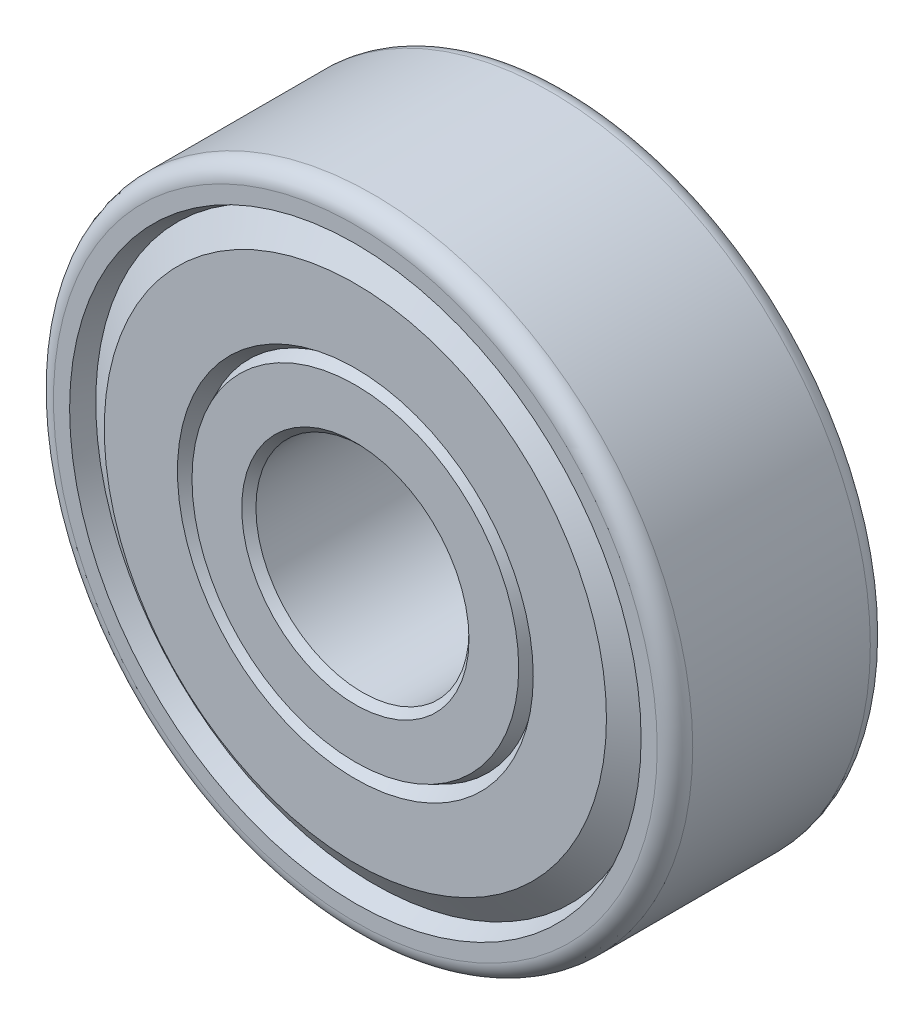
ISO-10303-21;
HEADER;
FILE_DESCRIPTION(('STEP AP214'),'2;1');
FILE_NAME('part.step','',(''),(''),'','','');
FILE_SCHEMA(('AUTOMOTIVE_DESIGN { 1 0 10303 214 1 1 1 1 }'));
ENDSEC;
DATA;
#1=APPLICATION_CONTEXT('core data for automotive mechanical design processes');
#2=APPLICATION_PROTOCOL_DEFINITION('international standard','automotive_design',2000,#1);
#3=PRODUCT_CONTEXT('',#1,'mechanical');
#4=PRODUCT('Part','Part','',(#3));
#5=PRODUCT_RELATED_PRODUCT_CATEGORY('part','',(#4));
#6=PRODUCT_DEFINITION_FORMATION('','',#4);
#7=PRODUCT_DEFINITION_CONTEXT('part definition',#1,'design');
#8=PRODUCT_DEFINITION('design','',#6,#7);
#9=PRODUCT_DEFINITION_SHAPE('','',#8);
#10=(LENGTH_UNIT() NAMED_UNIT(*) SI_UNIT(.MILLI.,.METRE.));
#11=(NAMED_UNIT(*) PLANE_ANGLE_UNIT() SI_UNIT($,.RADIAN.));
#12=(NAMED_UNIT(*) SI_UNIT($,.STERADIAN.) SOLID_ANGLE_UNIT());
#13=UNCERTAINTY_MEASURE_WITH_UNIT(LENGTH_MEASURE(1.E-05),#10,'distance_accuracy_value','');
#14=(GEOMETRIC_REPRESENTATION_CONTEXT(3) GLOBAL_UNCERTAINTY_ASSIGNED_CONTEXT((#13)) GLOBAL_UNIT_ASSIGNED_CONTEXT((#10,
#11,#12)) REPRESENTATION_CONTEXT('',''));
#15=CARTESIAN_POINT('',(0.,0.,0.));
#16=DIRECTION('',(0.,0.,1.));
#17=DIRECTION('',(1.,0.,0.));
#18=AXIS2_PLACEMENT_3D('',#15,#16,#17);
#19=CARTESIAN_POINT('',(7.3025,0.,-4.7624999995719));
#20=DIRECTION('',(0.,0.,-1.));
#21=DIRECTION('',(-1.,0.,0.));
#22=AXIS2_PLACEMENT_3D('',#19,#20,#21);
#23=PLANE('',#22);
#24=CARTESIAN_POINT('',(0.,0.,-4.7624999995719));
#25=DIRECTION('',(0.,0.,1.));
#26=DIRECTION('',(1.,0.,0.));
#27=AXIS2_PLACEMENT_3D('',#24,#25,#26);
#28=CIRCLE('',#27,5.07999999979347);
#29=CARTESIAN_POINT('',(5.07999999979347,0.,-4.7624999995719));
#30=VERTEX_POINT('',#29);
#31=EDGE_CURVE('E10',#30,#30,#28,.T.);
#32=ORIENTED_EDGE('',*,*,#31,.T.);
#33=EDGE_LOOP('',(#32));
#34=FACE_BOUND('',#33,.T.);
#35=CARTESIAN_POINT('',(0.,0.,-4.7624999995719));
#36=DIRECTION('',(0.,0.,1.));
#37=DIRECTION('',(1.,0.,0.));
#38=AXIS2_PLACEMENT_3D('',#35,#36,#37);
#39=CIRCLE('',#38,7.3025);
#40=CARTESIAN_POINT('',(7.3025,0.,-4.7624999995719));
#41=VERTEX_POINT('',#40);
#42=EDGE_CURVE('E94',#41,#41,#39,.T.);
#43=ORIENTED_EDGE('',*,*,#42,.F.);
#44=EDGE_LOOP('',(#43));
#45=FACE_BOUND('',#44,.T.);
#46=ADVANCED_FACE('F30',(#34,#45),#23,.T.);
#47=CARTESIAN_POINT('',(0.,0.,-4.7624999995719));
#48=DIRECTION('',(0.,0.,-1.));
#49=DIRECTION('',(-1.,0.,0.));
#50=AXIS2_PLACEMENT_3D('',#47,#48,#49);
#51=CONICAL_SURFACE('',#50,5.07999999979347,0.785398163397448);
#52=CARTESIAN_POINT('',(0.,0.,-4.4449999995777));
#53=DIRECTION('',(0.,0.,1.));
#54=DIRECTION('',(1.,0.,0.));
#55=AXIS2_PLACEMENT_3D('',#52,#53,#54);
#56=CIRCLE('',#55,4.76249999979927);
#57=CARTESIAN_POINT('',(4.76249999979927,0.,-4.4449999995777));
#58=VERTEX_POINT('',#57);
#59=EDGE_CURVE('E36',#58,#58,#56,.T.);
#60=ORIENTED_EDGE('',*,*,#59,.T.);
#61=EDGE_LOOP('',(#60));
#62=FACE_BOUND('',#61,.T.);
#63=ORIENTED_EDGE('',*,*,#31,.F.);
#64=EDGE_LOOP('',(#63));
#65=FACE_BOUND('',#64,.T.);
#66=ADVANCED_FACE('F102',(#62,#65),#51,.F.);
#67=CARTESIAN_POINT('',(0.,0.,-4.76375000000002));
#68=DIRECTION('',(0.,0.,1.));
#69=DIRECTION('',(1.,0.,0.));
#70=AXIS2_PLACEMENT_3D('',#67,#68,#69);
#71=CYLINDRICAL_SURFACE('',#70,4.76249999979927);
#72=CARTESIAN_POINT('',(0.,0.,4.44500000014614));
#73=DIRECTION('',(0.,0.,1.));
#74=DIRECTION('',(1.,0.,0.));
#75=AXIS2_PLACEMENT_3D('',#72,#73,#74);
#76=CIRCLE('',#75,4.76249999979927);
#77=CARTESIAN_POINT('',(4.76249999979927,0.,4.44500000014614));
#78=VERTEX_POINT('',#77);
#79=EDGE_CURVE('E40',#78,#78,#76,.T.);
#80=ORIENTED_EDGE('',*,*,#79,.T.);
#81=EDGE_LOOP('',(#80));
#82=FACE_BOUND('',#81,.T.);
#83=ORIENTED_EDGE('',*,*,#59,.F.);
#84=EDGE_LOOP('',(#83));
#85=FACE_BOUND('',#84,.T.);
#86=ADVANCED_FACE('F106',(#82,#85),#71,.F.);
#87=CARTESIAN_POINT('',(0.,0.,4.44500000014614));
#88=DIRECTION('',(0.,0.,1.));
#89=DIRECTION('',(1.,0.,0.));
#90=AXIS2_PLACEMENT_3D('',#87,#88,#89);
#91=CONICAL_SURFACE('',#90,4.76249999979927,0.785398163397448);
#92=CARTESIAN_POINT('',(0.,0.,4.76250000014034));
#93=DIRECTION('',(0.,0.,1.));
#94=DIRECTION('',(1.,0.,0.));
#95=AXIS2_PLACEMENT_3D('',#92,#93,#94);
#96=CIRCLE('',#95,5.07999999979347);
#97=CARTESIAN_POINT('',(5.07999999979347,0.,4.76250000014034));
#98=VERTEX_POINT('',#97);
#99=EDGE_CURVE('E44',#98,#98,#96,.T.);
#100=ORIENTED_EDGE('',*,*,#99,.T.);
#101=EDGE_LOOP('',(#100));
#102=FACE_BOUND('',#101,.T.);
#103=ORIENTED_EDGE('',*,*,#79,.F.);
#104=EDGE_LOOP('',(#103));
#105=FACE_BOUND('',#104,.T.);
#106=ADVANCED_FACE('F110',(#102,#105),#91,.F.);
#107=CARTESIAN_POINT('',(5.07999999979347,0.,4.76250000014034));
#108=DIRECTION('',(0.,0.,1.));
#109=DIRECTION('',(1.,0.,0.));
#110=AXIS2_PLACEMENT_3D('',#107,#108,#109);
#111=PLANE('',#110);
#112=CARTESIAN_POINT('',(0.,0.,4.76250000014034));
#113=DIRECTION('',(0.,0.,1.));
#114=DIRECTION('',(1.,0.,0.));
#115=AXIS2_PLACEMENT_3D('',#112,#113,#114);
#116=CIRCLE('',#115,7.30250000013546);
#117=CARTESIAN_POINT('',(7.30250000013546,0.,4.76250000014034));
#118=VERTEX_POINT('',#117);
#119=EDGE_CURVE('E49',#118,#118,#116,.T.);
#120=ORIENTED_EDGE('',*,*,#119,.T.);
#121=EDGE_LOOP('',(#120));
#122=FACE_BOUND('',#121,.T.);
#123=ORIENTED_EDGE('',*,*,#99,.F.);
#124=EDGE_LOOP('',(#123));
#125=FACE_BOUND('',#124,.T.);
#126=ADVANCED_FACE('F117',(#122,#125),#111,.T.);
#127=CARTESIAN_POINT('',(0.,0.,4.76250000014034));
#128=DIRECTION('',(0.,0.,-1.));
#129=DIRECTION('',(-1.,0.,0.));
#130=AXIS2_PLACEMENT_3D('',#127,#128,#129);
#131=CONICAL_SURFACE('',#130,7.30250000013546,0.407917424795081);
#132=CARTESIAN_POINT('',(0.,0.,4.18132890082251));
#133=DIRECTION('',(0.,0.,1.));
#134=DIRECTION('',(1.,0.,0.));
#135=AXIS2_PLACEMENT_3D('',#132,#133,#134);
#136=CIRCLE('',#135,7.55365742482294);
#137=CARTESIAN_POINT('',(7.55365742482294,0.,4.18132890082251));
#138=VERTEX_POINT('',#137);
#139=EDGE_CURVE('E52',#138,#138,#136,.T.);
#140=ORIENTED_EDGE('',*,*,#139,.T.);
#141=EDGE_LOOP('',(#140));
#142=FACE_BOUND('',#141,.T.);
#143=ORIENTED_EDGE('',*,*,#119,.F.);
#144=EDGE_LOOP('',(#143));
#145=FACE_BOUND('',#144,.T.);
#146=ADVANCED_FACE('F121',(#142,#145),#131,.T.);
#147=CARTESIAN_POINT('',(0.,0.,4.18132890082251));
#148=DIRECTION('',(0.,0.,1.));
#149=DIRECTION('',(1.,0.,0.));
#150=AXIS2_PLACEMENT_3D('',#147,#148,#149);
#151=CONICAL_SURFACE('',#150,7.55365742482294,0.601029540180864);
#152=CARTESIAN_POINT('',(0.,0.,4.76250000014034));
#153=DIRECTION('',(0.,0.,1.));
#154=DIRECTION('',(1.,0.,0.));
#155=AXIS2_PLACEMENT_3D('',#152,#153,#154);
#156=CIRCLE('',#155,7.95213697272844);
#157=CARTESIAN_POINT('',(7.95213697272844,0.,4.76250000014034));
#158=VERTEX_POINT('',#157);
#159=EDGE_CURVE('E55',#158,#158,#156,.T.);
#160=ORIENTED_EDGE('',*,*,#159,.T.);
#161=EDGE_LOOP('',(#160));
#162=FACE_BOUND('',#161,.T.);
#163=ORIENTED_EDGE('',*,*,#139,.F.);
#164=EDGE_LOOP('',(#163));
#165=FACE_BOUND('',#164,.T.);
#166=ADVANCED_FACE('F125',(#162,#165),#151,.F.);
#167=CARTESIAN_POINT('',(7.95213697272844,0.,4.76250000014034));
#168=DIRECTION('',(0.,0.,1.));
#169=DIRECTION('',(1.,0.,0.));
#170=AXIS2_PLACEMENT_3D('',#167,#168,#169);
#171=PLANE('',#170);
#172=CARTESIAN_POINT('',(0.,0.,4.76250000014034));
#173=DIRECTION('',(0.,0.,1.));
#174=DIRECTION('',(1.,0.,0.));
#175=AXIS2_PLACEMENT_3D('',#172,#173,#174);
#176=CIRCLE('',#175,11.2241326948103);
#177=CARTESIAN_POINT('',(11.2241326948103,0.,4.76250000014034));
#178=VERTEX_POINT('',#177);
#179=EDGE_CURVE('E58',#178,#178,#176,.T.);
#180=ORIENTED_EDGE('',*,*,#179,.T.);
#181=EDGE_LOOP('',(#180));
#182=FACE_BOUND('',#181,.T.);
#183=ORIENTED_EDGE('',*,*,#159,.F.);
#184=EDGE_LOOP('',(#183));
#185=FACE_BOUND('',#184,.T.);
#186=ADVANCED_FACE('F129',(#182,#185),#171,.T.);
#187=CARTESIAN_POINT('',(0.,0.,4.76250000014034));
#188=DIRECTION('',(0.,0.,-1.));
#189=DIRECTION('',(-1.,0.,0.));
#190=AXIS2_PLACEMENT_3D('',#187,#188,#189);
#191=CONICAL_SURFACE('',#190,11.2241326948103,0.969766785464896);
#192=CARTESIAN_POINT('',(0.,0.,3.93017144165326));
#193=DIRECTION('',(0.,0.,1.));
#194=DIRECTION('',(1.,0.,0.));
#195=AXIS2_PLACEMENT_3D('',#192,#193,#194);
#196=CIRCLE('',#195,12.4380602468774);
#197=CARTESIAN_POINT('',(12.4380602468774,0.,3.93017144165326));
#198=VERTEX_POINT('',#197);
#199=EDGE_CURVE('E61',#198,#198,#196,.T.);
#200=ORIENTED_EDGE('',*,*,#199,.T.);
#201=EDGE_LOOP('',(#200));
#202=FACE_BOUND('',#201,.T.);
#203=ORIENTED_EDGE('',*,*,#179,.F.);
#204=EDGE_LOOP('',(#203));
#205=FACE_BOUND('',#204,.T.);
#206=ADVANCED_FACE('F133',(#202,#205),#191,.T.);
#207=CARTESIAN_POINT('',(0.,0.,3.93017144165326));
#208=DIRECTION('',(0.,0.,1.));
#209=DIRECTION('',(1.,0.,0.));
#210=AXIS2_PLACEMENT_3D('',#207,#208,#209);
#211=CONICAL_SURFACE('',#210,12.4380602468774,0.382519397582066);
#212=CARTESIAN_POINT('',(0.,0.,4.76250000014034));
#213=DIRECTION('',(0.,0.,1.));
#214=DIRECTION('',(1.,0.,0.));
#215=AXIS2_PLACEMENT_3D('',#212,#213,#214);
#216=CIRCLE('',#215,12.7729368126781);
#217=CARTESIAN_POINT('',(12.7729368126781,0.,4.76250000014034));
#218=VERTEX_POINT('',#217);
#219=EDGE_CURVE('E64',#218,#218,#216,.T.);
#220=ORIENTED_EDGE('',*,*,#219,.T.);
#221=EDGE_LOOP('',(#220));
#222=FACE_BOUND('',#221,.T.);
#223=ORIENTED_EDGE('',*,*,#199,.F.);
#224=EDGE_LOOP('',(#223));
#225=FACE_BOUND('',#224,.T.);
#226=ADVANCED_FACE('F137',(#222,#225),#211,.F.);
#227=CARTESIAN_POINT('',(12.7729368126781,0.,4.76250000014034));
#228=DIRECTION('',(0.,0.,1.));
#229=DIRECTION('',(1.,0.,0.));
#230=AXIS2_PLACEMENT_3D('',#227,#228,#229);
#231=PLANE('',#230);
#232=CARTESIAN_POINT('',(0.,0.,4.76250000014033));
#233=DIRECTION('',(0.,0.,1.));
#234=DIRECTION('',(1.,0.,0.));
#235=AXIS2_PLACEMENT_3D('',#232,#233,#234);
#236=CIRCLE('',#235,13.49375);
#237=CARTESIAN_POINT('',(13.49375,0.,4.76250000014033));
#238=VERTEX_POINT('',#237);
#239=EDGE_CURVE('E67',#238,#238,#236,.T.);
#240=ORIENTED_EDGE('',*,*,#239,.T.);
#241=EDGE_LOOP('',(#240));
#242=FACE_BOUND('',#241,.T.);
#243=ORIENTED_EDGE('',*,*,#219,.F.);
#244=EDGE_LOOP('',(#243));
#245=FACE_BOUND('',#244,.T.);
#246=ADVANCED_FACE('F141',(#242,#245),#231,.T.);
#247=CARTESIAN_POINT('',(0.,0.,3.96875000014034));
#248=DIRECTION('',(0.,0.,1.));
#249=DIRECTION('',(1.,0.,0.));
#250=AXIS2_PLACEMENT_3D('',#247,#248,#249);
#251=TOROIDAL_SURFACE('',#250,13.49375,0.793749999999989);
#252=CARTESIAN_POINT('',(0.,0.,3.96875000014034));
#253=DIRECTION('',(0.,0.,1.));
#254=DIRECTION('',(1.,0.,0.));
#255=AXIS2_PLACEMENT_3D('',#252,#253,#254);
#256=CIRCLE('',#255,14.2875);
#257=CARTESIAN_POINT('',(14.2875,0.,3.96875000014034));
#258=VERTEX_POINT('',#257);
#259=EDGE_CURVE('E70',#258,#258,#256,.T.);
#260=ORIENTED_EDGE('',*,*,#259,.T.);
#261=EDGE_LOOP('',(#260));
#262=FACE_BOUND('',#261,.T.);
#263=ORIENTED_EDGE('',*,*,#239,.F.);
#264=EDGE_LOOP('',(#263));
#265=FACE_BOUND('',#264,.T.);
#266=ADVANCED_FACE('F145',(#262,#265),#251,.T.);
#267=CARTESIAN_POINT('',(0.,0.,-4.76375000000002));
#268=DIRECTION('',(0.,0.,1.));
#269=DIRECTION('',(1.,0.,0.));
#270=AXIS2_PLACEMENT_3D('',#267,#268,#269);
#271=CYLINDRICAL_SURFACE('',#270,14.2875);
#272=CARTESIAN_POINT('',(0.,0.,-3.9687499995719));
#273=DIRECTION('',(0.,0.,1.));
#274=DIRECTION('',(1.,0.,0.));
#275=AXIS2_PLACEMENT_3D('',#272,#273,#274);
#276=CIRCLE('',#275,14.2875);
#277=CARTESIAN_POINT('',(14.2875,0.,-3.9687499995719));
#278=VERTEX_POINT('',#277);
#279=EDGE_CURVE('E73',#278,#278,#276,.T.);
#280=ORIENTED_EDGE('',*,*,#279,.T.);
#281=EDGE_LOOP('',(#280));
#282=FACE_BOUND('',#281,.T.);
#283=ORIENTED_EDGE('',*,*,#259,.F.);
#284=EDGE_LOOP('',(#283));
#285=FACE_BOUND('',#284,.T.);
#286=ADVANCED_FACE('F149',(#282,#285),#271,.T.);
#287=CARTESIAN_POINT('',(0.,0.,-3.9687499995719));
#288=DIRECTION('',(0.,0.,1.));
#289=DIRECTION('',(1.,0.,0.));
#290=AXIS2_PLACEMENT_3D('',#287,#288,#289);
#291=TOROIDAL_SURFACE('',#290,13.49375,0.793750000000002);
#292=CARTESIAN_POINT('',(0.,0.,-4.7624999995719));
#293=DIRECTION('',(0.,0.,1.));
#294=DIRECTION('',(1.,0.,0.));
#295=AXIS2_PLACEMENT_3D('',#292,#293,#294);
#296=CIRCLE('',#295,13.49375);
#297=CARTESIAN_POINT('',(13.49375,0.,-4.7624999995719));
#298=VERTEX_POINT('',#297);
#299=EDGE_CURVE('E76',#298,#298,#296,.T.);
#300=ORIENTED_EDGE('',*,*,#299,.T.);
#301=EDGE_LOOP('',(#300));
#302=FACE_BOUND('',#301,.T.);
#303=ORIENTED_EDGE('',*,*,#279,.F.);
#304=EDGE_LOOP('',(#303));
#305=FACE_BOUND('',#304,.T.);
#306=ADVANCED_FACE('F153',(#302,#305),#291,.T.);
#307=CARTESIAN_POINT('',(13.49375,0.,-4.7624999995719));
#308=DIRECTION('',(0.,0.,-1.));
#309=DIRECTION('',(-1.,0.,0.));
#310=AXIS2_PLACEMENT_3D('',#307,#308,#309);
#311=PLANE('',#310);
#312=CARTESIAN_POINT('',(0.,0.,-4.7624999995719));
#313=DIRECTION('',(0.,0.,1.));
#314=DIRECTION('',(1.,0.,0.));
#315=AXIS2_PLACEMENT_3D('',#312,#313,#314);
#316=CIRCLE('',#315,12.7729368128599);
#317=CARTESIAN_POINT('',(12.7729368128599,0.,-4.7624999995719));
#318=VERTEX_POINT('',#317);
#319=EDGE_CURVE('E79',#318,#318,#316,.T.);
#320=ORIENTED_EDGE('',*,*,#319,.T.);
#321=EDGE_LOOP('',(#320));
#322=FACE_BOUND('',#321,.T.);
#323=ORIENTED_EDGE('',*,*,#299,.F.);
#324=EDGE_LOOP('',(#323));
#325=FACE_BOUND('',#324,.T.);
#326=ADVANCED_FACE('F157',(#322,#325),#311,.T.);
#327=CARTESIAN_POINT('',(0.,0.,-4.7624999995719));
#328=DIRECTION('',(0.,0.,-1.));
#329=DIRECTION('',(-1.,0.,0.));
#330=AXIS2_PLACEMENT_3D('',#327,#328,#329);
#331=CONICAL_SURFACE('',#330,12.7729368128599,0.382519398268519);
#332=CARTESIAN_POINT('',(0.,0.,-3.93017144183061));
#333=DIRECTION('',(0.,0.,1.));
#334=DIRECTION('',(1.,0.,0.));
#335=AXIS2_PLACEMENT_3D('',#332,#333,#334);
#336=CIRCLE('',#335,12.4380602466955);
#337=CARTESIAN_POINT('',(12.4380602466955,0.,-3.93017144183061));
#338=VERTEX_POINT('',#337);
#339=EDGE_CURVE('E82',#338,#338,#336,.T.);
#340=ORIENTED_EDGE('',*,*,#339,.T.);
#341=EDGE_LOOP('',(#340));
#342=FACE_BOUND('',#341,.T.);
#343=ORIENTED_EDGE('',*,*,#319,.F.);
#344=EDGE_LOOP('',(#343));
#345=FACE_BOUND('',#344,.T.);
#346=ADVANCED_FACE('F161',(#342,#345),#331,.F.);
#347=CARTESIAN_POINT('',(0.,0.,-3.93017144183061));
#348=DIRECTION('',(0.,0.,1.));
#349=DIRECTION('',(1.,0.,0.));
#350=AXIS2_PLACEMENT_3D('',#347,#348,#349);
#351=CONICAL_SURFACE('',#350,12.4380602466955,0.969766785990075);
#352=CARTESIAN_POINT('',(0.,0.,-4.7624999995719));
#353=DIRECTION('',(0.,0.,1.));
#354=DIRECTION('',(1.,0.,0.));
#355=AXIS2_PLACEMENT_3D('',#352,#353,#354);
#356=CIRCLE('',#355,11.2241326943492);
#357=CARTESIAN_POINT('',(11.2241326943492,0.,-4.7624999995719));
#358=VERTEX_POINT('',#357);
#359=EDGE_CURVE('E85',#358,#358,#356,.T.);
#360=ORIENTED_EDGE('',*,*,#359,.T.);
#361=EDGE_LOOP('',(#360));
#362=FACE_BOUND('',#361,.T.);
#363=ORIENTED_EDGE('',*,*,#339,.F.);
#364=EDGE_LOOP('',(#363));
#365=FACE_BOUND('',#364,.T.);
#366=ADVANCED_FACE('F165',(#362,#365),#351,.T.);
#367=CARTESIAN_POINT('',(11.2241326943492,0.,-4.7624999995719));
#368=DIRECTION('',(0.,0.,-1.));
#369=DIRECTION('',(-1.,0.,0.));
#370=AXIS2_PLACEMENT_3D('',#367,#368,#369);
#371=PLANE('',#370);
#372=CARTESIAN_POINT('',(0.,0.,-4.7624999995719));
#373=DIRECTION('',(0.,0.,1.));
#374=DIRECTION('',(1.,0.,0.));
#375=AXIS2_PLACEMENT_3D('',#372,#373,#374);
#376=CIRCLE('',#375,7.952136972928);
#377=CARTESIAN_POINT('',(7.952136972928,0.,-4.7624999995719));
#378=VERTEX_POINT('',#377);
#379=EDGE_CURVE('E88',#378,#378,#376,.T.);
#380=ORIENTED_EDGE('',*,*,#379,.T.);
#381=EDGE_LOOP('',(#380));
#382=FACE_BOUND('',#381,.T.);
#383=ORIENTED_EDGE('',*,*,#359,.F.);
#384=EDGE_LOOP('',(#383));
#385=FACE_BOUND('',#384,.T.);
#386=ADVANCED_FACE('F169',(#382,#385),#371,.T.);
#387=CARTESIAN_POINT('',(0.,0.,-4.7624999995719));
#388=DIRECTION('',(0.,0.,-1.));
#389=DIRECTION('',(-1.,0.,0.));
#390=AXIS2_PLACEMENT_3D('',#387,#388,#389);
#391=CONICAL_SURFACE('',#390,7.952136972928,0.601029540804809);
#392=CARTESIAN_POINT('',(0.,0.,-4.18132890044945));
#393=DIRECTION('',(0.,0.,1.));
#394=DIRECTION('',(1.,0.,0.));
#395=AXIS2_PLACEMENT_3D('',#392,#393,#394);
#396=CIRCLE('',#395,7.55365742462337);
#397=CARTESIAN_POINT('',(7.55365742462337,0.,-4.18132890044945));
#398=VERTEX_POINT('',#397);
#399=EDGE_CURVE('E91',#398,#398,#396,.T.);
#400=ORIENTED_EDGE('',*,*,#399,.T.);
#401=EDGE_LOOP('',(#400));
#402=FACE_BOUND('',#401,.T.);
#403=ORIENTED_EDGE('',*,*,#379,.F.);
#404=EDGE_LOOP('',(#403));
#405=FACE_BOUND('',#404,.T.);
#406=ADVANCED_FACE('F173',(#402,#405),#391,.F.);
#407=CARTESIAN_POINT('',(0.,0.,-4.18132890044945));
#408=DIRECTION('',(0.,0.,1.));
#409=DIRECTION('',(1.,0.,0.));
#410=AXIS2_PLACEMENT_3D('',#407,#408,#409);
#411=CONICAL_SURFACE('',#410,7.55365742462337,0.407917424824542);
#412=ORIENTED_EDGE('',*,*,#42,.T.);
#413=EDGE_LOOP('',(#412));
#414=FACE_BOUND('',#413,.T.);
#415=ORIENTED_EDGE('',*,*,#399,.F.);
#416=EDGE_LOOP('',(#415));
#417=FACE_BOUND('',#416,.T.);
#418=ADVANCED_FACE('F98',(#414,#417),#411,.T.);
#419=CLOSED_SHELL('',(#46,#66,#86,#106,#126,#146,#166,#186,#206,#226,#246,#266,#286,#306,#326,
#346,#366,#386,#406,#418));
#420=MANIFOLD_SOLID_BREP('B2',#419);
#421=ADVANCED_BREP_SHAPE_REPRESENTATION('',(#18,#420),#14);
#422=SHAPE_DEFINITION_REPRESENTATION(#9,#421);
ENDSEC;
END-ISO-10303-21;
